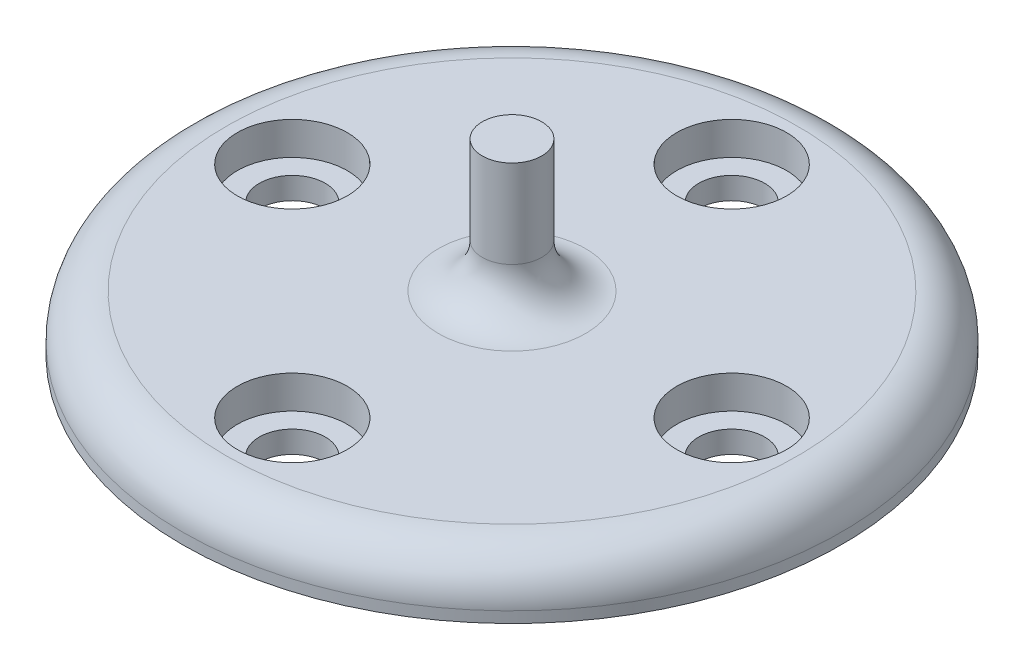
ISO-10303-21;
HEADER;
FILE_DESCRIPTION(('STEP AP214'),'2;1');
FILE_NAME('part.step','',(''),(''),'','','');
FILE_SCHEMA(('AUTOMOTIVE_DESIGN { 1 0 10303 214 1 1 1 1 }'));
ENDSEC;
DATA;
#1=APPLICATION_CONTEXT('core data for automotive mechanical design processes');
#2=APPLICATION_PROTOCOL_DEFINITION('international standard','automotive_design',2000,#1);
#3=PRODUCT_CONTEXT('',#1,'mechanical');
#4=PRODUCT('Part','Part','',(#3));
#5=PRODUCT_RELATED_PRODUCT_CATEGORY('part','',(#4));
#6=PRODUCT_DEFINITION_FORMATION('','',#4);
#7=PRODUCT_DEFINITION_CONTEXT('part definition',#1,'design');
#8=PRODUCT_DEFINITION('design','',#6,#7);
#9=PRODUCT_DEFINITION_SHAPE('','',#8);
#10=(LENGTH_UNIT() NAMED_UNIT(*) SI_UNIT(.MILLI.,.METRE.));
#11=(NAMED_UNIT(*) PLANE_ANGLE_UNIT() SI_UNIT($,.RADIAN.));
#12=(NAMED_UNIT(*) SI_UNIT($,.STERADIAN.) SOLID_ANGLE_UNIT());
#13=UNCERTAINTY_MEASURE_WITH_UNIT(LENGTH_MEASURE(1.E-05),#10,'distance_accuracy_value','');
#14=(GEOMETRIC_REPRESENTATION_CONTEXT(3) GLOBAL_UNCERTAINTY_ASSIGNED_CONTEXT((#13)) GLOBAL_UNIT_ASSIGNED_CONTEXT((#10,
#11,#12)) REPRESENTATION_CONTEXT('',''));
#15=CARTESIAN_POINT('',(0.,0.,0.));
#16=DIRECTION('',(0.,0.,1.));
#17=DIRECTION('',(1.,0.,0.));
#18=AXIS2_PLACEMENT_3D('',#15,#16,#17);
#19=CARTESIAN_POINT('',(0.,0.,-10.));
#20=DIRECTION('',(0.,1.,0.));
#21=DIRECTION('',(0.,0.,1.));
#22=AXIS2_PLACEMENT_3D('',#19,#20,#21);
#23=CYLINDRICAL_SURFACE('',#22,1.5);
#24=CARTESIAN_POINT('',(0.,0.,-10.));
#25=DIRECTION('',(0.,1.,0.));
#26=DIRECTION('',(0.,0.,1.));
#27=AXIS2_PLACEMENT_3D('',#24,#25,#26);
#28=CIRCLE('',#27,1.5);
#29=CARTESIAN_POINT('',(0.,0.,-8.5));
#30=VERTEX_POINT('',#29);
#31=EDGE_CURVE('E76',#30,#30,#28,.T.);
#32=ORIENTED_EDGE('',*,*,#31,.F.);
#33=EDGE_LOOP('',(#32));
#34=FACE_BOUND('',#33,.T.);
#35=CARTESIAN_POINT('',(0.,1.,-10.));
#36=DIRECTION('',(0.,1.,0.));
#37=DIRECTION('',(0.,0.,1.));
#38=AXIS2_PLACEMENT_3D('',#35,#36,#37);
#39=CIRCLE('',#38,1.5);
#40=CARTESIAN_POINT('',(0.,1.,-8.5));
#41=VERTEX_POINT('',#40);
#42=EDGE_CURVE('E72',#41,#41,#39,.F.);
#43=ORIENTED_EDGE('',*,*,#42,.F.);
#44=EDGE_LOOP('',(#43));
#45=FACE_BOUND('',#44,.T.);
#46=ADVANCED_FACE('F44',(#34,#45),#23,.F.);
#47=CARTESIAN_POINT('',(0.,2.5,0.));
#48=DIRECTION('',(0.,-1.,0.));
#49=DIRECTION('',(0.,0.,-1.));
#50=AXIS2_PLACEMENT_3D('',#47,#48,#49);
#51=CYLINDRICAL_SURFACE('',#50,15.);
#52=CARTESIAN_POINT('',(0.,0.5,0.));
#53=DIRECTION('',(0.,1.,0.));
#54=DIRECTION('',(0.,0.,1.));
#55=AXIS2_PLACEMENT_3D('',#52,#53,#54);
#56=CIRCLE('',#55,15.);
#57=CARTESIAN_POINT('',(0.,0.5,15.));
#58=VERTEX_POINT('',#57);
#59=EDGE_CURVE('E10',#58,#58,#56,.F.);
#60=ORIENTED_EDGE('',*,*,#59,.T.);
#61=EDGE_LOOP('',(#60));
#62=FACE_BOUND('',#61,.T.);
#63=CARTESIAN_POINT('',(0.,0.,0.));
#64=DIRECTION('',(0.,1.,0.));
#65=DIRECTION('',(0.,0.,1.));
#66=AXIS2_PLACEMENT_3D('',#63,#64,#65);
#67=CIRCLE('',#66,15.);
#68=CARTESIAN_POINT('',(0.,0.,15.));
#69=VERTEX_POINT('',#68);
#70=EDGE_CURVE('E71',#69,#69,#67,.T.);
#71=ORIENTED_EDGE('',*,*,#70,.T.);
#72=EDGE_LOOP('',(#71));
#73=FACE_BOUND('',#72,.T.);
#74=ADVANCED_FACE('F162',(#62,#73),#51,.T.);
#75=CARTESIAN_POINT('',(0.,2.5,0.));
#76=DIRECTION('',(0.,1.,0.));
#77=DIRECTION('',(0.,0.,1.));
#78=AXIS2_PLACEMENT_3D('',#75,#76,#77);
#79=PLANE('',#78);
#80=CARTESIAN_POINT('',(0.,2.5,0.));
#81=DIRECTION('',(0.,1.,0.));
#82=DIRECTION('',(0.,0.,1.));
#83=AXIS2_PLACEMENT_3D('',#80,#81,#82);
#84=CIRCLE('',#83,13.);
#85=CARTESIAN_POINT('',(0.,2.5,13.));
#86=VERTEX_POINT('',#85);
#87=EDGE_CURVE('E52',#86,#86,#84,.T.);
#88=ORIENTED_EDGE('',*,*,#87,.T.);
#89=EDGE_LOOP('',(#88));
#90=FACE_BOUND('',#89,.T.);
#91=CARTESIAN_POINT('',(0.,2.5,0.));
#92=DIRECTION('',(0.,1.,0.));
#93=DIRECTION('',(0.,0.,1.));
#94=AXIS2_PLACEMENT_3D('',#91,#92,#93);
#95=CIRCLE('',#94,3.35);
#96=CARTESIAN_POINT('',(0.,2.5,3.35));
#97=VERTEX_POINT('',#96);
#98=EDGE_CURVE('E59',#97,#97,#95,.F.);
#99=ORIENTED_EDGE('',*,*,#98,.T.);
#100=EDGE_LOOP('',(#99));
#101=FACE_BOUND('',#100,.T.);
#102=CARTESIAN_POINT('',(10.,2.5,0.));
#103=DIRECTION('',(0.,1.,0.));
#104=DIRECTION('',(-1.,0.,0.));
#105=AXIS2_PLACEMENT_3D('',#102,#103,#104);
#106=CIRCLE('',#105,2.5);
#107=CARTESIAN_POINT('',(7.5,2.5,0.));
#108=VERTEX_POINT('',#107);
#109=EDGE_CURVE('E129',#108,#108,#106,.T.);
#110=ORIENTED_EDGE('',*,*,#109,.F.);
#111=EDGE_LOOP('',(#110));
#112=FACE_BOUND('',#111,.T.);
#113=CARTESIAN_POINT('',(0.,2.5,10.));
#114=DIRECTION('',(0.,1.,0.));
#115=DIRECTION('',(0.,0.,-1.));
#116=AXIS2_PLACEMENT_3D('',#113,#114,#115);
#117=CIRCLE('',#116,2.5);
#118=CARTESIAN_POINT('',(0.,2.5,7.5));
#119=VERTEX_POINT('',#118);
#120=EDGE_CURVE('E119',#119,#119,#117,.T.);
#121=ORIENTED_EDGE('',*,*,#120,.F.);
#122=EDGE_LOOP('',(#121));
#123=FACE_BOUND('',#122,.T.);
#124=CARTESIAN_POINT('',(-10.,2.5,-1.04744440165294E-13));
#125=DIRECTION('',(0.,1.,0.));
#126=DIRECTION('',(1.,0.,0.));
#127=AXIS2_PLACEMENT_3D('',#124,#125,#126);
#128=CIRCLE('',#127,2.5);
#129=CARTESIAN_POINT('',(-7.5,2.5,0.));
#130=VERTEX_POINT('',#129);
#131=EDGE_CURVE('E120',#130,#130,#128,.T.);
#132=ORIENTED_EDGE('',*,*,#131,.F.);
#133=EDGE_LOOP('',(#132));
#134=FACE_BOUND('',#133,.T.);
#135=CARTESIAN_POINT('',(0.,2.5,-10.));
#136=DIRECTION('',(0.,1.,0.));
#137=DIRECTION('',(0.,0.,1.));
#138=AXIS2_PLACEMENT_3D('',#135,#136,#137);
#139=CIRCLE('',#138,2.5);
#140=CARTESIAN_POINT('',(0.,2.5,-7.5));
#141=VERTEX_POINT('',#140);
#142=EDGE_CURVE('E83',#141,#141,#139,.T.);
#143=ORIENTED_EDGE('',*,*,#142,.F.);
#144=EDGE_LOOP('',(#143));
#145=FACE_BOUND('',#144,.T.);
#146=ADVANCED_FACE('F168',(#90,#101,#112,#123,#134,#145),#79,.T.);
#147=CARTESIAN_POINT('',(0.,0.,0.));
#148=DIRECTION('',(0.,1.,0.));
#149=DIRECTION('',(0.,0.,1.));
#150=AXIS2_PLACEMENT_3D('',#147,#148,#149);
#151=PLANE('',#150);
#152=CARTESIAN_POINT('',(10.,0.,0.));
#153=DIRECTION('',(0.,1.,0.));
#154=DIRECTION('',(-1.,0.,0.));
#155=AXIS2_PLACEMENT_3D('',#152,#153,#154);
#156=CIRCLE('',#155,1.5);
#157=CARTESIAN_POINT('',(8.5,0.,0.));
#158=VERTEX_POINT('',#157);
#159=EDGE_CURVE('E87',#158,#158,#156,.T.);
#160=ORIENTED_EDGE('',*,*,#159,.T.);
#161=EDGE_LOOP('',(#160));
#162=FACE_BOUND('',#161,.T.);
#163=CARTESIAN_POINT('',(0.,0.,10.));
#164=DIRECTION('',(0.,1.,0.));
#165=DIRECTION('',(0.,0.,-1.));
#166=AXIS2_PLACEMENT_3D('',#163,#164,#165);
#167=CIRCLE('',#166,1.5);
#168=CARTESIAN_POINT('',(0.,0.,8.5));
#169=VERTEX_POINT('',#168);
#170=EDGE_CURVE('E95',#169,#169,#167,.T.);
#171=ORIENTED_EDGE('',*,*,#170,.T.);
#172=EDGE_LOOP('',(#171));
#173=FACE_BOUND('',#172,.T.);
#174=CARTESIAN_POINT('',(-10.,0.,-1.04744440165294E-13));
#175=DIRECTION('',(0.,1.,0.));
#176=DIRECTION('',(1.,0.,0.));
#177=AXIS2_PLACEMENT_3D('',#174,#175,#176);
#178=CIRCLE('',#177,1.5);
#179=CARTESIAN_POINT('',(-8.5,0.,0.));
#180=VERTEX_POINT('',#179);
#181=EDGE_CURVE('E91',#180,#180,#178,.T.);
#182=ORIENTED_EDGE('',*,*,#181,.T.);
#183=EDGE_LOOP('',(#182));
#184=FACE_BOUND('',#183,.T.);
#185=ORIENTED_EDGE('',*,*,#31,.T.);
#186=EDGE_LOOP('',(#185));
#187=FACE_BOUND('',#186,.T.);
#188=ORIENTED_EDGE('',*,*,#70,.F.);
#189=EDGE_LOOP('',(#188));
#190=FACE_BOUND('',#189,.T.);
#191=ADVANCED_FACE('F178',(#162,#173,#184,#187,#190),#151,.F.);
#192=CARTESIAN_POINT('',(0.,1.,-10.));
#193=DIRECTION('',(0.,1.,0.));
#194=DIRECTION('',(0.,0.,1.));
#195=AXIS2_PLACEMENT_3D('',#192,#193,#194);
#196=PLANE('',#195);
#197=CARTESIAN_POINT('',(0.,1.,-10.));
#198=DIRECTION('',(0.,1.,0.));
#199=DIRECTION('',(0.,0.,1.));
#200=AXIS2_PLACEMENT_3D('',#197,#198,#199);
#201=CIRCLE('',#200,2.5);
#202=CARTESIAN_POINT('',(0.,1.,-7.5));
#203=VERTEX_POINT('',#202);
#204=EDGE_CURVE('E77',#203,#203,#201,.T.);
#205=ORIENTED_EDGE('',*,*,#204,.T.);
#206=EDGE_LOOP('',(#205));
#207=FACE_BOUND('',#206,.T.);
#208=ORIENTED_EDGE('',*,*,#42,.T.);
#209=EDGE_LOOP('',(#208));
#210=FACE_BOUND('',#209,.T.);
#211=ADVANCED_FACE('F180',(#207,#210),#196,.T.);
#212=CARTESIAN_POINT('',(0.,1.,-10.));
#213=DIRECTION('',(0.,1.,0.));
#214=DIRECTION('',(0.,0.,1.));
#215=AXIS2_PLACEMENT_3D('',#212,#213,#214);
#216=CYLINDRICAL_SURFACE('',#215,2.5);
#217=ORIENTED_EDGE('',*,*,#204,.F.);
#218=EDGE_LOOP('',(#217));
#219=FACE_BOUND('',#218,.T.);
#220=ORIENTED_EDGE('',*,*,#142,.T.);
#221=EDGE_LOOP('',(#220));
#222=FACE_BOUND('',#221,.T.);
#223=ADVANCED_FACE('F174',(#219,#222),#216,.F.);
#224=CARTESIAN_POINT('',(-10.,0.,-1.04744440165294E-13));
#225=DIRECTION('',(0.,1.,0.));
#226=DIRECTION('',(1.,0.,0.));
#227=AXIS2_PLACEMENT_3D('',#224,#225,#226);
#228=CYLINDRICAL_SURFACE('',#227,1.5);
#229=ORIENTED_EDGE('',*,*,#181,.F.);
#230=EDGE_LOOP('',(#229));
#231=FACE_BOUND('',#230,.T.);
#232=CARTESIAN_POINT('',(-10.,1.,-1.04744440165294E-13));
#233=DIRECTION('',(0.,1.,0.));
#234=DIRECTION('',(0.,0.,1.));
#235=AXIS2_PLACEMENT_3D('',#232,#233,#234);
#236=CIRCLE('',#235,1.5);
#237=CARTESIAN_POINT('',(-10.,1.,1.4999999999999));
#238=VERTEX_POINT('',#237);
#239=EDGE_CURVE('E96',#238,#238,#236,.F.);
#240=ORIENTED_EDGE('',*,*,#239,.F.);
#241=EDGE_LOOP('',(#240));
#242=FACE_BOUND('',#241,.T.);
#243=ADVANCED_FACE('F202',(#231,#242),#228,.F.);
#244=CARTESIAN_POINT('',(0.,0.,10.));
#245=DIRECTION('',(0.,1.,0.));
#246=DIRECTION('',(0.,0.,-1.));
#247=AXIS2_PLACEMENT_3D('',#244,#245,#246);
#248=CYLINDRICAL_SURFACE('',#247,1.5);
#249=ORIENTED_EDGE('',*,*,#170,.F.);
#250=EDGE_LOOP('',(#249));
#251=FACE_BOUND('',#250,.T.);
#252=CARTESIAN_POINT('',(0.,1.,10.));
#253=DIRECTION('',(0.,1.,0.));
#254=DIRECTION('',(0.,0.,1.));
#255=AXIS2_PLACEMENT_3D('',#252,#253,#254);
#256=CIRCLE('',#255,1.5);
#257=CARTESIAN_POINT('',(0.,1.,11.5));
#258=VERTEX_POINT('',#257);
#259=EDGE_CURVE('E106',#258,#258,#256,.F.);
#260=ORIENTED_EDGE('',*,*,#259,.F.);
#261=EDGE_LOOP('',(#260));
#262=FACE_BOUND('',#261,.T.);
#263=ADVANCED_FACE('F208',(#251,#262),#248,.F.);
#264=CARTESIAN_POINT('',(10.,0.,0.));
#265=DIRECTION('',(0.,1.,0.));
#266=DIRECTION('',(-1.,0.,0.));
#267=AXIS2_PLACEMENT_3D('',#264,#265,#266);
#268=CYLINDRICAL_SURFACE('',#267,1.5);
#269=ORIENTED_EDGE('',*,*,#159,.F.);
#270=EDGE_LOOP('',(#269));
#271=FACE_BOUND('',#270,.T.);
#272=CARTESIAN_POINT('',(10.,1.,0.));
#273=DIRECTION('',(0.,1.,0.));
#274=DIRECTION('',(0.,0.,1.));
#275=AXIS2_PLACEMENT_3D('',#272,#273,#274);
#276=CIRCLE('',#275,1.5);
#277=CARTESIAN_POINT('',(10.,1.,1.50000000000003));
#278=VERTEX_POINT('',#277);
#279=EDGE_CURVE('E110',#278,#278,#276,.F.);
#280=ORIENTED_EDGE('',*,*,#279,.F.);
#281=EDGE_LOOP('',(#280));
#282=FACE_BOUND('',#281,.T.);
#283=ADVANCED_FACE('F220',(#271,#282),#268,.F.);
#284=CARTESIAN_POINT('',(10.,1.,0.));
#285=DIRECTION('',(0.,1.,0.));
#286=DIRECTION('',(-1.,0.,0.));
#287=AXIS2_PLACEMENT_3D('',#284,#285,#286);
#288=PLANE('',#287);
#289=CARTESIAN_POINT('',(10.,1.,0.));
#290=DIRECTION('',(0.,1.,0.));
#291=DIRECTION('',(-1.,0.,0.));
#292=AXIS2_PLACEMENT_3D('',#289,#290,#291);
#293=CIRCLE('',#292,2.5);
#294=CARTESIAN_POINT('',(7.5,1.,0.));
#295=VERTEX_POINT('',#294);
#296=EDGE_CURVE('E114',#295,#295,#293,.T.);
#297=ORIENTED_EDGE('',*,*,#296,.T.);
#298=EDGE_LOOP('',(#297));
#299=FACE_BOUND('',#298,.T.);
#300=ORIENTED_EDGE('',*,*,#279,.T.);
#301=EDGE_LOOP('',(#300));
#302=FACE_BOUND('',#301,.T.);
#303=ADVANCED_FACE('F224',(#299,#302),#288,.T.);
#304=CARTESIAN_POINT('',(10.,1.,0.));
#305=DIRECTION('',(0.,1.,0.));
#306=DIRECTION('',(-1.,0.,0.));
#307=AXIS2_PLACEMENT_3D('',#304,#305,#306);
#308=CYLINDRICAL_SURFACE('',#307,2.5);
#309=ORIENTED_EDGE('',*,*,#296,.F.);
#310=EDGE_LOOP('',(#309));
#311=FACE_BOUND('',#310,.T.);
#312=ORIENTED_EDGE('',*,*,#109,.T.);
#313=EDGE_LOOP('',(#312));
#314=FACE_BOUND('',#313,.T.);
#315=ADVANCED_FACE('F233',(#311,#314),#308,.F.);
#316=CARTESIAN_POINT('',(0.,1.,10.));
#317=DIRECTION('',(0.,1.,0.));
#318=DIRECTION('',(0.,0.,-1.));
#319=AXIS2_PLACEMENT_3D('',#316,#317,#318);
#320=PLANE('',#319);
#321=CARTESIAN_POINT('',(0.,1.,10.));
#322=DIRECTION('',(0.,1.,0.));
#323=DIRECTION('',(0.,0.,-1.));
#324=AXIS2_PLACEMENT_3D('',#321,#322,#323);
#325=CIRCLE('',#324,2.5);
#326=CARTESIAN_POINT('',(0.,1.,7.5));
#327=VERTEX_POINT('',#326);
#328=EDGE_CURVE('E125',#327,#327,#325,.T.);
#329=ORIENTED_EDGE('',*,*,#328,.T.);
#330=EDGE_LOOP('',(#329));
#331=FACE_BOUND('',#330,.T.);
#332=ORIENTED_EDGE('',*,*,#259,.T.);
#333=EDGE_LOOP('',(#332));
#334=FACE_BOUND('',#333,.T.);
#335=ADVANCED_FACE('F230',(#331,#334),#320,.T.);
#336=CARTESIAN_POINT('',(0.,1.,10.));
#337=DIRECTION('',(0.,1.,0.));
#338=DIRECTION('',(0.,0.,-1.));
#339=AXIS2_PLACEMENT_3D('',#336,#337,#338);
#340=CYLINDRICAL_SURFACE('',#339,2.5);
#341=ORIENTED_EDGE('',*,*,#328,.F.);
#342=EDGE_LOOP('',(#341));
#343=FACE_BOUND('',#342,.T.);
#344=ORIENTED_EDGE('',*,*,#120,.T.);
#345=EDGE_LOOP('',(#344));
#346=FACE_BOUND('',#345,.T.);
#347=ADVANCED_FACE('F227',(#343,#346),#340,.F.);
#348=CARTESIAN_POINT('',(-10.,1.,-1.04744440165294E-13));
#349=DIRECTION('',(0.,1.,0.));
#350=DIRECTION('',(1.,0.,0.));
#351=AXIS2_PLACEMENT_3D('',#348,#349,#350);
#352=PLANE('',#351);
#353=CARTESIAN_POINT('',(-10.,1.,-1.04744440165294E-13));
#354=DIRECTION('',(0.,1.,0.));
#355=DIRECTION('',(1.,0.,0.));
#356=AXIS2_PLACEMENT_3D('',#353,#354,#355);
#357=CIRCLE('',#356,2.5);
#358=CARTESIAN_POINT('',(-7.5,1.,0.));
#359=VERTEX_POINT('',#358);
#360=EDGE_CURVE('E115',#359,#359,#357,.T.);
#361=ORIENTED_EDGE('',*,*,#360,.T.);
#362=EDGE_LOOP('',(#361));
#363=FACE_BOUND('',#362,.T.);
#364=ORIENTED_EDGE('',*,*,#239,.T.);
#365=EDGE_LOOP('',(#364));
#366=FACE_BOUND('',#365,.T.);
#367=ADVANCED_FACE('F157',(#363,#366),#352,.T.);
#368=CARTESIAN_POINT('',(-10.,1.,-1.04744440165294E-13));
#369=DIRECTION('',(0.,1.,0.));
#370=DIRECTION('',(1.,0.,0.));
#371=AXIS2_PLACEMENT_3D('',#368,#369,#370);
#372=CYLINDRICAL_SURFACE('',#371,2.5);
#373=ORIENTED_EDGE('',*,*,#360,.F.);
#374=EDGE_LOOP('',(#373));
#375=FACE_BOUND('',#374,.T.);
#376=ORIENTED_EDGE('',*,*,#131,.T.);
#377=EDGE_LOOP('',(#376));
#378=FACE_BOUND('',#377,.T.);
#379=ADVANCED_FACE('F148',(#375,#378),#372,.F.);
#380=CARTESIAN_POINT('',(0.,8.5,0.));
#381=DIRECTION('',(0.,-1.,0.));
#382=DIRECTION('',(0.,0.,-1.));
#383=AXIS2_PLACEMENT_3D('',#380,#381,#382);
#384=CYLINDRICAL_SURFACE('',#383,1.35);
#385=CARTESIAN_POINT('',(0.,4.5,0.));
#386=DIRECTION('',(0.,1.,0.));
#387=DIRECTION('',(0.,0.,1.));
#388=AXIS2_PLACEMENT_3D('',#385,#386,#387);
#389=CIRCLE('',#388,1.35);
#390=CARTESIAN_POINT('',(0.,4.5,1.35));
#391=VERTEX_POINT('',#390);
#392=EDGE_CURVE('E65',#391,#391,#389,.T.);
#393=ORIENTED_EDGE('',*,*,#392,.T.);
#394=EDGE_LOOP('',(#393));
#395=FACE_BOUND('',#394,.T.);
#396=CARTESIAN_POINT('',(0.,8.5,0.));
#397=DIRECTION('',(0.,1.,0.));
#398=DIRECTION('',(0.,0.,1.));
#399=AXIS2_PLACEMENT_3D('',#396,#397,#398);
#400=CIRCLE('',#399,1.35);
#401=CARTESIAN_POINT('',(0.,8.5,1.35));
#402=VERTEX_POINT('',#401);
#403=EDGE_CURVE('E124',#402,#402,#400,.T.);
#404=ORIENTED_EDGE('',*,*,#403,.F.);
#405=EDGE_LOOP('',(#404));
#406=FACE_BOUND('',#405,.T.);
#407=ADVANCED_FACE('F146',(#395,#406),#384,.T.);
#408=CARTESIAN_POINT('',(0.,8.5,0.));
#409=DIRECTION('',(0.,1.,0.));
#410=DIRECTION('',(0.,0.,1.));
#411=AXIS2_PLACEMENT_3D('',#408,#409,#410);
#412=PLANE('',#411);
#413=ORIENTED_EDGE('',*,*,#403,.T.);
#414=EDGE_LOOP('',(#413));
#415=FACE_BOUND('',#414,.T.);
#416=ADVANCED_FACE('F144',(#415),#412,.T.);
#417=CARTESIAN_POINT('',(0.,4.5,0.));
#418=DIRECTION('',(0.,1.,0.));
#419=DIRECTION('',(0.,0.,1.));
#420=AXIS2_PLACEMENT_3D('',#417,#418,#419);
#421=TOROIDAL_SURFACE('',#420,3.35,2.);
#422=ORIENTED_EDGE('',*,*,#98,.F.);
#423=EDGE_LOOP('',(#422));
#424=FACE_BOUND('',#423,.T.);
#425=ORIENTED_EDGE('',*,*,#392,.F.);
#426=EDGE_LOOP('',(#425));
#427=FACE_BOUND('',#426,.T.);
#428=ADVANCED_FACE('F155',(#424,#427),#421,.F.);
#429=CARTESIAN_POINT('',(0.,0.5,0.));
#430=DIRECTION('',(0.,1.,0.));
#431=DIRECTION('',(0.,0.,1.));
#432=AXIS2_PLACEMENT_3D('',#429,#430,#431);
#433=TOROIDAL_SURFACE('',#432,13.,2.);
#434=ORIENTED_EDGE('',*,*,#59,.F.);
#435=EDGE_LOOP('',(#434));
#436=FACE_BOUND('',#435,.T.);
#437=ORIENTED_EDGE('',*,*,#87,.F.);
#438=EDGE_LOOP('',(#437));
#439=FACE_BOUND('',#438,.T.);
#440=ADVANCED_FACE('F46',(#436,#439),#433,.T.);
#441=CLOSED_SHELL('',(#46,#74,#146,#191,#211,#223,#243,#263,#283,#303,#315,#335,#347,#367,#379,
#407,#416,#428,#440));
#442=MANIFOLD_SOLID_BREP('B2',#441);
#443=ADVANCED_BREP_SHAPE_REPRESENTATION('',(#18,#442),#14);
#444=SHAPE_DEFINITION_REPRESENTATION(#9,#443);
ENDSEC;
END-ISO-10303-21;
